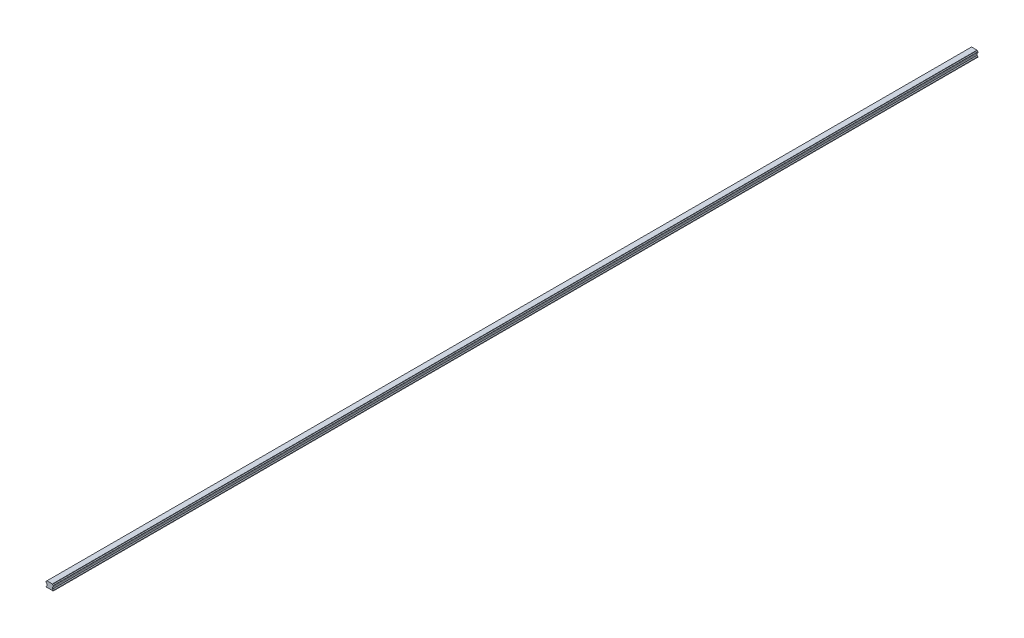
ISO-10303-21;
HEADER;
FILE_DESCRIPTION(('STEP AP214'),'2;1');
FILE_NAME('part.step','',(''),(''),'','','');
FILE_SCHEMA(('AUTOMOTIVE_DESIGN { 1 0 10303 214 1 1 1 1 }'));
ENDSEC;
DATA;
#1=APPLICATION_CONTEXT('core data for automotive mechanical design processes');
#2=APPLICATION_PROTOCOL_DEFINITION('international standard','automotive_design',2000,#1);
#3=PRODUCT_CONTEXT('',#1,'mechanical');
#4=PRODUCT('Part','Part','',(#3));
#5=PRODUCT_RELATED_PRODUCT_CATEGORY('part','',(#4));
#6=PRODUCT_DEFINITION_FORMATION('','',#4);
#7=PRODUCT_DEFINITION_CONTEXT('part definition',#1,'design');
#8=PRODUCT_DEFINITION('design','',#6,#7);
#9=PRODUCT_DEFINITION_SHAPE('','',#8);
#10=(LENGTH_UNIT() NAMED_UNIT(*) SI_UNIT(.MILLI.,.METRE.));
#11=(NAMED_UNIT(*) PLANE_ANGLE_UNIT() SI_UNIT($,.RADIAN.));
#12=(NAMED_UNIT(*) SI_UNIT($,.STERADIAN.) SOLID_ANGLE_UNIT());
#13=UNCERTAINTY_MEASURE_WITH_UNIT(LENGTH_MEASURE(1.E-05),#10,'distance_accuracy_value','');
#14=(GEOMETRIC_REPRESENTATION_CONTEXT(3) GLOBAL_UNCERTAINTY_ASSIGNED_CONTEXT((#13)) GLOBAL_UNIT_ASSIGNED_CONTEXT((#10,
#11,#12)) REPRESENTATION_CONTEXT('',''));
#15=CARTESIAN_POINT('',(0.,0.,0.));
#16=DIRECTION('',(0.,0.,1.));
#17=DIRECTION('',(1.,0.,0.));
#18=AXIS2_PLACEMENT_3D('',#15,#16,#17);
#19=CARTESIAN_POINT('',(-54230.8177693005,54214.4005653113,2897.));
#20=DIRECTION('',(0.707106781186546,0.707106781186549,0.));
#21=DIRECTION('',(-0.707106781186549,0.707106781186546,0.));
#22=AXIS2_PLACEMENT_3D('',#19,#20,#21);
#23=PLANE('',#22);
#24=DIRECTION('',(0.707106781186549,-0.707106781186546,0.));
#25=VECTOR('',#24,1.);
#26=CARTESIAN_POINT('',(-54230.8177693005,54214.4005653113,0.));
#27=LINE('',#26,#25);
#28=CARTESIAN_POINT('',(-10.5913828555799,-5.82582113338503,0.));
#29=VERTEX_POINT('',#28);
#30=CARTESIAN_POINT('',(-10.3951216023396,-6.02208238665242,0.));
#31=VERTEX_POINT('',#30);
#32=EDGE_CURVE('E212',#29,#31,#27,.T.);
#33=ORIENTED_EDGE('',*,*,#32,.T.);
#34=DIRECTION('',(0.,0.,-1.));
#35=VECTOR('',#34,1.);
#36=CARTESIAN_POINT('',(-10.3951216023396,-6.02208238665242,2897.));
#37=LINE('',#36,#35);
#38=CARTESIAN_POINT('',(-10.3951216023396,-6.02208238665242,2897.));
#39=VERTEX_POINT('',#38);
#40=EDGE_CURVE('E11',#39,#31,#37,.T.);
#41=ORIENTED_EDGE('',*,*,#40,.F.);
#42=DIRECTION('',(0.707106781186549,-0.707106781186546,0.));
#43=VECTOR('',#42,1.);
#44=CARTESIAN_POINT('',(-54230.8177693005,54214.4005653113,2897.));
#45=LINE('',#44,#43);
#46=CARTESIAN_POINT('',(-10.5913828555799,-5.82582113338503,2897.));
#47=VERTEX_POINT('',#46);
#48=EDGE_CURVE('E129',#47,#39,#45,.T.);
#49=ORIENTED_EDGE('',*,*,#48,.F.);
#50=DIRECTION('',(0.,0.,-1.));
#51=VECTOR('',#50,1.);
#52=CARTESIAN_POINT('',(-10.5913828555799,-5.82582113338503,2897.));
#53=LINE('',#52,#51);
#54=EDGE_CURVE('E211',#47,#29,#53,.T.);
#55=ORIENTED_EDGE('',*,*,#54,.T.);
#56=EDGE_LOOP('',(#33,#41,#49,#55));
#57=FACE_BOUND('',#56,.T.);
#58=ADVANCED_FACE('F32',(#57),#23,.F.);
#59=CARTESIAN_POINT('',(-10.5913828555866,-8.5358995422944,2897.));
#60=DIRECTION('',(0.,0.,-1.));
#61=DIRECTION('',(-1.,0.,0.));
#62=AXIS2_PLACEMENT_3D('',#59,#60,#61);
#63=CYLINDRICAL_SURFACE('',#62,2.52146686901217);
#64=CARTESIAN_POINT('',(-10.5913828555866,-8.5358995422944,0.));
#65=DIRECTION('',(0.,0.,1.));
#66=DIRECTION('',(1.,0.,0.));
#67=AXIS2_PLACEMENT_3D('',#64,#65,#66);
#68=CIRCLE('',#67,2.52146686901217);
#69=CARTESIAN_POINT('',(-8.07756569993501,-8.339638289101,0.));
#70=VERTEX_POINT('',#69);
#71=EDGE_CURVE('E215',#70,#31,#68,.T.);
#72=ORIENTED_EDGE('',*,*,#71,.F.);
#73=DIRECTION('',(0.,0.,-1.));
#74=VECTOR('',#73,1.);
#75=CARTESIAN_POINT('',(-8.07756569993501,-8.339638289101,2897.));
#76=LINE('',#75,#74);
#77=CARTESIAN_POINT('',(-8.07756569993501,-8.339638289101,2897.));
#78=VERTEX_POINT('',#77);
#79=EDGE_CURVE('E40',#78,#70,#76,.T.);
#80=ORIENTED_EDGE('',*,*,#79,.F.);
#81=CARTESIAN_POINT('',(-10.5913828555866,-8.5358995422944,2897.));
#82=DIRECTION('',(0.,0.,1.));
#83=DIRECTION('',(1.,0.,0.));
#84=AXIS2_PLACEMENT_3D('',#81,#82,#83);
#85=CIRCLE('',#84,2.52146686901217);
#86=EDGE_CURVE('E321',#78,#39,#85,.T.);
#87=ORIENTED_EDGE('',*,*,#86,.T.);
#88=ORIENTED_EDGE('',*,*,#40,.T.);
#89=EDGE_LOOP('',(#72,#80,#87,#88));
#90=FACE_BOUND('',#89,.T.);
#91=ADVANCED_FACE('F320',(#90),#63,.F.);
#92=CARTESIAN_POINT('',(-54230.8177693006,54214.4005653113,2897.));
#93=DIRECTION('',(0.707106781186546,0.707106781186549,0.));
#94=DIRECTION('',(-0.707106781186549,0.707106781186546,0.));
#95=AXIS2_PLACEMENT_3D('',#92,#93,#94);
#96=PLANE('',#95);
#97=DIRECTION('',(0.707106781186549,-0.707106781186546,0.));
#98=VECTOR('',#97,1.);
#99=CARTESIAN_POINT('',(-54230.8177693006,54214.4005653113,0.));
#100=LINE('',#99,#98);
#101=CARTESIAN_POINT('',(-7.56562261278759,-8.85158137623421,0.));
#102=VERTEX_POINT('',#101);
#103=EDGE_CURVE('E218',#70,#102,#100,.T.);
#104=ORIENTED_EDGE('',*,*,#103,.T.);
#105=DIRECTION('',(0.,0.,-1.));
#106=VECTOR('',#105,1.);
#107=CARTESIAN_POINT('',(-7.56562261278759,-8.85158137623421,2897.));
#108=LINE('',#107,#106);
#109=CARTESIAN_POINT('',(-7.56562261278759,-8.85158137623421,2897.));
#110=VERTEX_POINT('',#109);
#111=EDGE_CURVE('E304',#110,#102,#108,.T.);
#112=ORIENTED_EDGE('',*,*,#111,.F.);
#113=DIRECTION('',(0.707106781186549,-0.707106781186546,0.));
#114=VECTOR('',#113,1.);
#115=CARTESIAN_POINT('',(-54230.8177693006,54214.4005653113,2897.));
#116=LINE('',#115,#114);
#117=EDGE_CURVE('E311',#78,#110,#116,.T.);
#118=ORIENTED_EDGE('',*,*,#117,.F.);
#119=ORIENTED_EDGE('',*,*,#79,.T.);
#120=EDGE_LOOP('',(#104,#112,#118,#119));
#121=FACE_BOUND('',#120,.T.);
#122=ADVANCED_FACE('F309',(#121),#96,.F.);
#123=CARTESIAN_POINT('',(-7.56562261278759,-291553.774300648,2897.));
#124=DIRECTION('',(1.,0.,0.));
#125=DIRECTION('',(0.,0.,-1.));
#126=AXIS2_PLACEMENT_3D('',#123,#124,#125);
#127=PLANE('',#126);
#128=DIRECTION('',(0.,-1.,0.));
#129=VECTOR('',#128,1.);
#130=CARTESIAN_POINT('',(-7.56562261278759,-291553.774300648,0.));
#131=LINE('',#130,#129);
#132=CARTESIAN_POINT('',(-7.56562261273075,-13.8945151143162,0.));
#133=VERTEX_POINT('',#132);
#134=EDGE_CURVE('E220',#102,#133,#131,.T.);
#135=ORIENTED_EDGE('',*,*,#134,.T.);
#136=DIRECTION('',(0.,0.,-1.));
#137=VECTOR('',#136,1.);
#138=CARTESIAN_POINT('',(-7.56562261273075,-13.8945151143162,2897.));
#139=LINE('',#138,#137);
#140=CARTESIAN_POINT('',(-7.56562261273075,-13.8945151143162,2897.));
#141=VERTEX_POINT('',#140);
#142=EDGE_CURVE('E301',#141,#133,#139,.T.);
#143=ORIENTED_EDGE('',*,*,#142,.F.);
#144=DIRECTION('',(0.,-1.,0.));
#145=VECTOR('',#144,1.);
#146=CARTESIAN_POINT('',(-7.56562261278759,-291553.774300648,2897.));
#147=LINE('',#146,#145);
#148=EDGE_CURVE('E410',#110,#141,#147,.T.);
#149=ORIENTED_EDGE('',*,*,#148,.F.);
#150=ORIENTED_EDGE('',*,*,#111,.T.);
#151=EDGE_LOOP('',(#135,#143,#149,#150));
#152=FACE_BOUND('',#151,.T.);
#153=ADVANCED_FACE('F409',(#152),#127,.F.);
#154=CARTESIAN_POINT('',(-345773.219021702,-345779.547914204,2897.));
#155=DIRECTION('',(0.707106781186547,-0.707106781186548,0.));
#156=DIRECTION('',(0.707106781186548,0.707106781186547,0.));
#157=AXIS2_PLACEMENT_3D('',#154,#155,#156);
#158=PLANE('',#157);
#159=DIRECTION('',(-0.707106781186548,-0.707106781186547,0.));
#160=VECTOR('',#159,1.);
#161=CARTESIAN_POINT('',(-345773.219021702,-345779.547914204,0.));
#162=LINE('',#161,#160);
#163=CARTESIAN_POINT('',(-10.0870894817717,-16.4159819833003,0.));
#164=VERTEX_POINT('',#163);
#165=EDGE_CURVE('E222',#133,#164,#162,.T.);
#166=ORIENTED_EDGE('',*,*,#165,.T.);
#167=DIRECTION('',(0.,0.,-1.));
#168=VECTOR('',#167,1.);
#169=CARTESIAN_POINT('',(-10.0870894817717,-16.4159819833003,2897.));
#170=LINE('',#169,#168);
#171=CARTESIAN_POINT('',(-10.0870894817717,-16.4159819833003,2897.));
#172=VERTEX_POINT('',#171);
#173=EDGE_CURVE('E299',#172,#164,#170,.T.);
#174=ORIENTED_EDGE('',*,*,#173,.F.);
#175=DIRECTION('',(-0.707106781186548,-0.707106781186547,0.));
#176=VECTOR('',#175,1.);
#177=CARTESIAN_POINT('',(-345773.219021702,-345779.547914204,2897.));
#178=LINE('',#177,#176);
#179=EDGE_CURVE('E406',#141,#172,#178,.T.);
#180=ORIENTED_EDGE('',*,*,#179,.F.);
#181=ORIENTED_EDGE('',*,*,#142,.T.);
#182=EDGE_LOOP('',(#166,#174,#180,#181));
#183=FACE_BOUND('',#182,.T.);
#184=ADVANCED_FACE('F404',(#183),#158,.F.);
#185=CARTESIAN_POINT('',(-10.0870894817717,-291553.774300648,2897.));
#186=DIRECTION('',(-1.,0.,0.));
#187=DIRECTION('',(0.,0.,1.));
#188=AXIS2_PLACEMENT_3D('',#185,#186,#187);
#189=PLANE('',#188);
#190=DIRECTION('',(0.,1.,0.));
#191=VECTOR('',#190,1.);
#192=CARTESIAN_POINT('',(-10.0870894817717,-291553.774300648,0.));
#193=LINE('',#192,#191);
#194=CARTESIAN_POINT('',(-10.0870894817717,-17.7743006478295,0.));
#195=VERTEX_POINT('',#194);
#196=EDGE_CURVE('E225',#195,#164,#193,.T.);
#197=ORIENTED_EDGE('',*,*,#196,.F.);
#198=DIRECTION('',(0.,0.,-1.));
#199=VECTOR('',#198,1.);
#200=CARTESIAN_POINT('',(-10.0870894817717,-17.7743006478295,2897.));
#201=LINE('',#200,#199);
#202=CARTESIAN_POINT('',(-10.0870894817717,-17.7743006478295,2897.));
#203=VERTEX_POINT('',#202);
#204=EDGE_CURVE('E297',#203,#195,#201,.T.);
#205=ORIENTED_EDGE('',*,*,#204,.F.);
#206=DIRECTION('',(0.,1.,0.));
#207=VECTOR('',#206,1.);
#208=CARTESIAN_POINT('',(-10.0870894817717,-291553.774300648,2897.));
#209=LINE('',#208,#207);
#210=EDGE_CURVE('E401',#203,#172,#209,.T.);
#211=ORIENTED_EDGE('',*,*,#210,.T.);
#212=ORIENTED_EDGE('',*,*,#173,.T.);
#213=EDGE_LOOP('',(#197,#205,#211,#212));
#214=FACE_BOUND('',#213,.T.);
#215=ADVANCED_FACE('F397',(#214),#189,.T.);
#216=CARTESIAN_POINT('',(-399998.992635258,-17.7743006478295,2897.));
#217=DIRECTION('',(0.,-1.,0.));
#218=DIRECTION('',(0.,0.,-1.));
#219=AXIS2_PLACEMENT_3D('',#216,#217,#218);
#220=PLANE('',#219);
#221=DIRECTION('',(-1.,0.,0.));
#222=VECTOR('',#221,1.);
#223=CARTESIAN_POINT('',(-399998.992635258,-17.7743006478295,0.));
#224=LINE('',#223,#222);
#225=CARTESIAN_POINT('',(12.1018189655047,-17.7743006478295,0.));
#226=VERTEX_POINT('',#225);
#227=EDGE_CURVE('E228',#226,#195,#224,.T.);
#228=ORIENTED_EDGE('',*,*,#227,.F.);
#229=DIRECTION('',(0.,0.,-1.));
#230=VECTOR('',#229,1.);
#231=CARTESIAN_POINT('',(12.1018189655047,-17.7743006478295,2897.));
#232=LINE('',#231,#230);
#233=CARTESIAN_POINT('',(12.1018189655047,-17.7743006478295,2897.));
#234=VERTEX_POINT('',#233);
#235=EDGE_CURVE('E295',#234,#226,#232,.T.);
#236=ORIENTED_EDGE('',*,*,#235,.F.);
#237=DIRECTION('',(-1.,0.,0.));
#238=VECTOR('',#237,1.);
#239=CARTESIAN_POINT('',(-399998.992635258,-17.7743006478295,2897.));
#240=LINE('',#239,#238);
#241=EDGE_CURVE('E417',#234,#203,#240,.T.);
#242=ORIENTED_EDGE('',*,*,#241,.T.);
#243=ORIENTED_EDGE('',*,*,#204,.T.);
#244=EDGE_LOOP('',(#228,#236,#242,#243));
#245=FACE_BOUND('',#244,.T.);
#246=ADVANCED_FACE('F394',(#245),#220,.T.);
#247=CARTESIAN_POINT('',(12.1018189655047,-291553.774300648,2897.));
#248=DIRECTION('',(1.,0.,0.));
#249=DIRECTION('',(0.,0.,-1.));
#250=AXIS2_PLACEMENT_3D('',#247,#248,#249);
#251=PLANE('',#250);
#252=DIRECTION('',(0.,-1.,0.));
#253=VECTOR('',#252,1.);
#254=CARTESIAN_POINT('',(12.1018189655047,-291553.774300648,0.));
#255=LINE('',#254,#253);
#256=CARTESIAN_POINT('',(12.1018189655118,-16.4159819832363,0.));
#257=VERTEX_POINT('',#256);
#258=EDGE_CURVE('E231',#257,#226,#255,.T.);
#259=ORIENTED_EDGE('',*,*,#258,.F.);
#260=DIRECTION('',(0.,0.,-1.));
#261=VECTOR('',#260,1.);
#262=CARTESIAN_POINT('',(12.1018189655118,-16.4159819832363,2897.));
#263=LINE('',#262,#261);
#264=CARTESIAN_POINT('',(12.1018189655118,-16.4159819832363,2897.));
#265=VERTEX_POINT('',#264);
#266=EDGE_CURVE('E293',#265,#257,#263,.T.);
#267=ORIENTED_EDGE('',*,*,#266,.F.);
#268=DIRECTION('',(0.,-1.,0.));
#269=VECTOR('',#268,1.);
#270=CARTESIAN_POINT('',(12.1018189655047,-291553.774300648,2897.));
#271=LINE('',#270,#269);
#272=EDGE_CURVE('E390',#265,#234,#271,.T.);
#273=ORIENTED_EDGE('',*,*,#272,.T.);
#274=ORIENTED_EDGE('',*,*,#235,.T.);
#275=EDGE_LOOP('',(#259,#267,#273,#274));
#276=FACE_BOUND('',#275,.T.);
#277=ADVANCED_FACE('F387',(#276),#251,.T.);
#278=CARTESIAN_POINT('',(-54224.7662488138,54220.4520857961,2897.));
#279=DIRECTION('',(-0.707106781186548,-0.707106781186547,0.));
#280=DIRECTION('',(0.707106781186547,-0.707106781186548,0.));
#281=AXIS2_PLACEMENT_3D('',#278,#279,#280);
#282=PLANE('',#281);
#283=DIRECTION('',(-0.707106781186547,0.707106781186548,0.));
#284=VECTOR('',#283,1.);
#285=CARTESIAN_POINT('',(-54224.7662488138,54220.4520857961,0.));
#286=LINE('',#285,#284);
#287=CARTESIAN_POINT('',(9.58035209652053,-13.8945151142593,0.));
#288=VERTEX_POINT('',#287);
#289=EDGE_CURVE('E234',#257,#288,#286,.T.);
#290=ORIENTED_EDGE('',*,*,#289,.T.);
#291=DIRECTION('',(0.,0.,-1.));
#292=VECTOR('',#291,1.);
#293=CARTESIAN_POINT('',(9.58035209652053,-13.8945151142593,2897.));
#294=LINE('',#293,#292);
#295=CARTESIAN_POINT('',(9.58035209652053,-13.8945151142593,2897.));
#296=VERTEX_POINT('',#295);
#297=EDGE_CURVE('E290',#296,#288,#294,.T.);
#298=ORIENTED_EDGE('',*,*,#297,.F.);
#299=DIRECTION('',(-0.707106781186547,0.707106781186548,0.));
#300=VECTOR('',#299,1.);
#301=CARTESIAN_POINT('',(-54224.7662488138,54220.4520857961,2897.));
#302=LINE('',#301,#300);
#303=EDGE_CURVE('E383',#265,#296,#302,.T.);
#304=ORIENTED_EDGE('',*,*,#303,.F.);
#305=ORIENTED_EDGE('',*,*,#266,.T.);
#306=EDGE_LOOP('',(#290,#298,#304,#305));
#307=FACE_BOUND('',#306,.T.);
#308=ADVANCED_FACE('F382',(#307),#282,.F.);
#309=CARTESIAN_POINT('',(9.58035209652053,-291553.774300648,2897.));
#310=DIRECTION('',(-1.,0.,0.));
#311=DIRECTION('',(0.,0.,1.));
#312=AXIS2_PLACEMENT_3D('',#309,#310,#311);
#313=PLANE('',#312);
#314=DIRECTION('',(0.,1.,0.));
#315=VECTOR('',#314,1.);
#316=CARTESIAN_POINT('',(9.58035209652053,-291553.774300648,0.));
#317=LINE('',#316,#315);
#318=CARTESIAN_POINT('',(9.58035209657737,-8.85158137629105,0.));
#319=VERTEX_POINT('',#318);
#320=EDGE_CURVE('E236',#288,#319,#317,.T.);
#321=ORIENTED_EDGE('',*,*,#320,.T.);
#322=DIRECTION('',(0.,0.,-1.));
#323=VECTOR('',#322,1.);
#324=CARTESIAN_POINT('',(9.58035209657737,-8.85158137629105,2897.));
#325=LINE('',#324,#323);
#326=CARTESIAN_POINT('',(9.58035209657737,-8.85158137629105,2897.));
#327=VERTEX_POINT('',#326);
#328=EDGE_CURVE('E287',#327,#319,#325,.T.);
#329=ORIENTED_EDGE('',*,*,#328,.F.);
#330=DIRECTION('',(0.,1.,0.));
#331=VECTOR('',#330,1.);
#332=CARTESIAN_POINT('',(9.58035209652053,-291553.774300648,2897.));
#333=LINE('',#332,#331);
#334=EDGE_CURVE('E378',#296,#327,#333,.T.);
#335=ORIENTED_EDGE('',*,*,#334,.F.);
#336=ORIENTED_EDGE('',*,*,#297,.T.);
#337=EDGE_LOOP('',(#321,#329,#335,#336));
#338=FACE_BOUND('',#337,.T.);
#339=ADVANCED_FACE('F377',(#338),#313,.F.);
#340=CARTESIAN_POINT('',(-345767.167501216,-345785.59943469,2897.));
#341=DIRECTION('',(-0.707106781186549,0.707106781186546,0.));
#342=DIRECTION('',(-0.707106781186546,-0.707106781186549,0.));
#343=AXIS2_PLACEMENT_3D('',#340,#341,#342);
#344=PLANE('',#343);
#345=DIRECTION('',(0.707106781186546,0.707106781186549,0.));
#346=VECTOR('',#345,1.);
#347=CARTESIAN_POINT('',(-345767.167501216,-345785.59943469,0.));
#348=LINE('',#347,#346);
#349=CARTESIAN_POINT('',(10.0922951836753,-8.3396382891551,0.));
#350=VERTEX_POINT('',#349);
#351=EDGE_CURVE('E238',#319,#350,#348,.T.);
#352=ORIENTED_EDGE('',*,*,#351,.T.);
#353=DIRECTION('',(0.,0.,-1.));
#354=VECTOR('',#353,1.);
#355=CARTESIAN_POINT('',(10.0922951836753,-8.3396382891551,2897.));
#356=LINE('',#355,#354);
#357=CARTESIAN_POINT('',(10.0922951836753,-8.3396382891551,2897.));
#358=VERTEX_POINT('',#357);
#359=EDGE_CURVE('E285',#358,#350,#356,.T.);
#360=ORIENTED_EDGE('',*,*,#359,.F.);
#361=DIRECTION('',(0.707106781186546,0.707106781186549,0.));
#362=VECTOR('',#361,1.);
#363=CARTESIAN_POINT('',(-345767.167501216,-345785.59943469,2897.));
#364=LINE('',#363,#362);
#365=EDGE_CURVE('E374',#327,#358,#364,.T.);
#366=ORIENTED_EDGE('',*,*,#365,.F.);
#367=ORIENTED_EDGE('',*,*,#328,.T.);
#368=EDGE_LOOP('',(#352,#360,#366,#367));
#369=FACE_BOUND('',#368,.T.);
#370=ADVANCED_FACE('F371',(#369),#344,.F.);
#371=CARTESIAN_POINT('',(12.6061123393257,-8.53589954229437,2897.));
#372=DIRECTION('',(0.,0.,-1.));
#373=DIRECTION('',(-1.,0.,0.));
#374=AXIS2_PLACEMENT_3D('',#371,#372,#373);
#375=CYLINDRICAL_SURFACE('',#374,2.52146686901217);
#376=CARTESIAN_POINT('',(12.6061123393257,-8.53589954229437,0.));
#377=DIRECTION('',(0.,0.,1.));
#378=DIRECTION('',(1.,0.,0.));
#379=AXIS2_PLACEMENT_3D('',#376,#377,#378);
#380=CIRCLE('',#379,2.52146686901217);
#381=CARTESIAN_POINT('',(12.4098510862041,-6.02208238660751,0.));
#382=VERTEX_POINT('',#381);
#383=EDGE_CURVE('E241',#382,#350,#380,.T.);
#384=ORIENTED_EDGE('',*,*,#383,.F.);
#385=DIRECTION('',(0.,0.,-1.));
#386=VECTOR('',#385,1.);
#387=CARTESIAN_POINT('',(12.4098510862041,-6.02208238660751,2897.));
#388=LINE('',#387,#386);
#389=CARTESIAN_POINT('',(12.4098510862041,-6.02208238660751,2897.));
#390=VERTEX_POINT('',#389);
#391=EDGE_CURVE('E283',#390,#382,#388,.T.);
#392=ORIENTED_EDGE('',*,*,#391,.F.);
#393=CARTESIAN_POINT('',(12.6061123393257,-8.53589954229437,2897.));
#394=DIRECTION('',(0.,0.,1.));
#395=DIRECTION('',(1.,0.,0.));
#396=AXIS2_PLACEMENT_3D('',#393,#394,#395);
#397=CIRCLE('',#396,2.52146686901217);
#398=EDGE_CURVE('E365',#390,#358,#397,.T.);
#399=ORIENTED_EDGE('',*,*,#398,.T.);
#400=ORIENTED_EDGE('',*,*,#359,.T.);
#401=EDGE_LOOP('',(#384,#392,#399,#400));
#402=FACE_BOUND('',#401,.T.);
#403=ADVANCED_FACE('F364',(#402),#375,.F.);
#404=CARTESIAN_POINT('',(-345767.167501217,-345785.599434689,2897.));
#405=DIRECTION('',(-0.707106781186547,0.707106781186547,0.));
#406=DIRECTION('',(-0.707106781186548,-0.707106781186548,0.));
#407=AXIS2_PLACEMENT_3D('',#404,#405,#406);
#408=PLANE('',#407);
#409=DIRECTION('',(0.707106781186548,0.707106781186548,0.));
#410=VECTOR('',#409,1.);
#411=CARTESIAN_POINT('',(-345767.167501217,-345785.599434689,0.));
#412=LINE('',#411,#410);
#413=CARTESIAN_POINT('',(12.6061123393129,-5.82582113338503,0.));
#414=VERTEX_POINT('',#413);
#415=EDGE_CURVE('E244',#382,#414,#412,.T.);
#416=ORIENTED_EDGE('',*,*,#415,.T.);
#417=DIRECTION('',(0.,0.,-1.));
#418=VECTOR('',#417,1.);
#419=CARTESIAN_POINT('',(12.6061123393129,-5.82582113338503,2897.));
#420=LINE('',#419,#418);
#421=CARTESIAN_POINT('',(12.6061123393129,-5.82582113338503,2897.));
#422=VERTEX_POINT('',#421);
#423=EDGE_CURVE('E280',#422,#414,#420,.T.);
#424=ORIENTED_EDGE('',*,*,#423,.F.);
#425=DIRECTION('',(0.707106781186548,0.707106781186548,0.));
#426=VECTOR('',#425,1.);
#427=CARTESIAN_POINT('',(-345767.167501217,-345785.599434689,2897.));
#428=LINE('',#427,#426);
#429=EDGE_CURVE('E360',#390,#422,#428,.T.);
#430=ORIENTED_EDGE('',*,*,#429,.F.);
#431=ORIENTED_EDGE('',*,*,#391,.T.);
#432=EDGE_LOOP('',(#416,#424,#430,#431));
#433=FACE_BOUND('',#432,.T.);
#434=ADVANCED_FACE('F359',(#433),#408,.F.);
#435=CARTESIAN_POINT('',(12.6061123393129,-291553.774300648,2897.));
#436=DIRECTION('',(-1.,0.,0.));
#437=DIRECTION('',(0.,0.,1.));
#438=AXIS2_PLACEMENT_3D('',#435,#436,#437);
#439=PLANE('',#438);
#440=DIRECTION('',(0.,1.,0.));
#441=VECTOR('',#440,1.);
#442=CARTESIAN_POINT('',(12.6061123393129,-291553.774300648,0.));
#443=LINE('',#442,#441);
#444=CARTESIAN_POINT('',(12.60611233932,-2.80006089064244,0.));
#445=VERTEX_POINT('',#444);
#446=EDGE_CURVE('E246',#414,#445,#443,.T.);
#447=ORIENTED_EDGE('',*,*,#446,.T.);
#448=DIRECTION('',(0.,0.,-1.));
#449=VECTOR('',#448,1.);
#450=CARTESIAN_POINT('',(12.60611233932,-2.80006089064244,2897.));
#451=LINE('',#450,#449);
#452=CARTESIAN_POINT('',(12.60611233932,-2.80006089064244,2897.));
#453=VERTEX_POINT('',#452);
#454=EDGE_CURVE('E277',#453,#445,#451,.T.);
#455=ORIENTED_EDGE('',*,*,#454,.F.);
#456=DIRECTION('',(0.,1.,0.));
#457=VECTOR('',#456,1.);
#458=CARTESIAN_POINT('',(12.6061123393129,-291553.774300648,2897.));
#459=LINE('',#458,#457);
#460=EDGE_CURVE('E356',#422,#453,#459,.T.);
#461=ORIENTED_EDGE('',*,*,#460,.F.);
#462=ORIENTED_EDGE('',*,*,#423,.T.);
#463=EDGE_LOOP('',(#447,#455,#461,#462));
#464=FACE_BOUND('',#463,.T.);
#465=ADVANCED_FACE('F353',(#464),#439,.F.);
#466=CARTESIAN_POINT('',(-54217.7061415812,54227.5121930298,2897.));
#467=DIRECTION('',(-0.707106781186547,-0.707106781186548,0.));
#468=DIRECTION('',(0.707106781186548,-0.707106781186547,0.));
#469=AXIS2_PLACEMENT_3D('',#466,#467,#468);
#470=PLANE('',#469);
#471=DIRECTION('',(-0.707106781186548,0.707106781186547,0.));
#472=VECTOR('',#471,1.);
#473=CARTESIAN_POINT('',(-54217.7061415812,54227.5121930298,0.));
#474=LINE('',#473,#472);
#475=CARTESIAN_POINT('',(12.4098510860982,-2.60379963741146,0.));
#476=VERTEX_POINT('',#475);
#477=EDGE_CURVE('E248',#445,#476,#474,.T.);
#478=ORIENTED_EDGE('',*,*,#477,.T.);
#479=DIRECTION('',(0.,0.,-1.));
#480=VECTOR('',#479,1.);
#481=CARTESIAN_POINT('',(12.4098510860982,-2.60379963741146,2897.));
#482=LINE('',#481,#480);
#483=CARTESIAN_POINT('',(12.4098510860982,-2.60379963741146,2897.));
#484=VERTEX_POINT('',#483);
#485=EDGE_CURVE('E275',#484,#476,#482,.T.);
#486=ORIENTED_EDGE('',*,*,#485,.F.);
#487=DIRECTION('',(-0.707106781186548,0.707106781186547,0.));
#488=VECTOR('',#487,1.);
#489=CARTESIAN_POINT('',(-54217.7061415812,54227.5121930298,2897.));
#490=LINE('',#489,#488);
#491=EDGE_CURVE('E426',#453,#484,#490,.T.);
#492=ORIENTED_EDGE('',*,*,#491,.F.);
#493=ORIENTED_EDGE('',*,*,#454,.T.);
#494=EDGE_LOOP('',(#478,#486,#492,#493));
#495=FACE_BOUND('',#494,.T.);
#496=ADVANCED_FACE('F347',(#495),#470,.F.);
#497=CARTESIAN_POINT('',(12.6061123393258,-0.0899824817679875,2897.));
#498=DIRECTION('',(0.,0.,-1.));
#499=DIRECTION('',(-1.,0.,0.));
#500=AXIS2_PLACEMENT_3D('',#497,#498,#499);
#501=CYLINDRICAL_SURFACE('',#500,2.52146686901215);
#502=CARTESIAN_POINT('',(12.6061123393258,-0.0899824817679875,0.));
#503=DIRECTION('',(0.,0.,1.));
#504=DIRECTION('',(1.,0.,0.));
#505=AXIS2_PLACEMENT_3D('',#502,#503,#504);
#506=CIRCLE('',#505,2.52146686901215);
#507=CARTESIAN_POINT('',(10.092295183675,-0.286243734990421,0.));
#508=VERTEX_POINT('',#507);
#509=EDGE_CURVE('E251',#508,#476,#506,.T.);
#510=ORIENTED_EDGE('',*,*,#509,.F.);
#511=DIRECTION('',(0.,0.,-1.));
#512=VECTOR('',#511,1.);
#513=CARTESIAN_POINT('',(10.092295183675,-0.286243734990421,2897.));
#514=LINE('',#513,#512);
#515=CARTESIAN_POINT('',(10.092295183675,-0.286243734990421,2897.));
#516=VERTEX_POINT('',#515);
#517=EDGE_CURVE('E273',#516,#508,#514,.T.);
#518=ORIENTED_EDGE('',*,*,#517,.F.);
#519=CARTESIAN_POINT('',(12.6061123393258,-0.0899824817679875,2897.));
#520=DIRECTION('',(0.,0.,1.));
#521=DIRECTION('',(1.,0.,0.));
#522=AXIS2_PLACEMENT_3D('',#519,#520,#521);
#523=CIRCLE('',#522,2.52146686901215);
#524=EDGE_CURVE('E344',#516,#484,#523,.T.);
#525=ORIENTED_EDGE('',*,*,#524,.T.);
#526=ORIENTED_EDGE('',*,*,#485,.T.);
#527=EDGE_LOOP('',(#510,#518,#525,#526));
#528=FACE_BOUND('',#527,.T.);
#529=ADVANCED_FACE('F341',(#528),#501,.F.);
#530=CARTESIAN_POINT('',(-54217.7061415813,54227.5121930298,2897.));
#531=DIRECTION('',(-0.707106781186547,-0.707106781186548,0.));
#532=DIRECTION('',(0.707106781186548,-0.707106781186547,0.));
#533=AXIS2_PLACEMENT_3D('',#530,#531,#532);
#534=PLANE('',#533);
#535=DIRECTION('',(-0.707106781186548,0.707106781186547,0.));
#536=VECTOR('',#535,1.);
#537=CARTESIAN_POINT('',(-54217.7061415813,54227.5121930298,0.));
#538=LINE('',#537,#536);
#539=CARTESIAN_POINT('',(9.58035209652053,0.225699352199626,0.));
#540=VERTEX_POINT('',#539);
#541=EDGE_CURVE('E254',#508,#540,#538,.T.);
#542=ORIENTED_EDGE('',*,*,#541,.T.);
#543=DIRECTION('',(0.,0.,-1.));
#544=VECTOR('',#543,1.);
#545=CARTESIAN_POINT('',(9.58035209652053,0.225699352199626,2897.));
#546=LINE('',#545,#544);
#547=CARTESIAN_POINT('',(9.58035209652053,0.225699352199626,2897.));
#548=VERTEX_POINT('',#547);
#549=EDGE_CURVE('E270',#548,#540,#546,.T.);
#550=ORIENTED_EDGE('',*,*,#549,.F.);
#551=DIRECTION('',(-0.707106781186548,0.707106781186547,0.));
#552=VECTOR('',#551,1.);
#553=CARTESIAN_POINT('',(-54217.7061415813,54227.5121930298,2897.));
#554=LINE('',#553,#552);
#555=EDGE_CURVE('E336',#516,#548,#554,.T.);
#556=ORIENTED_EDGE('',*,*,#555,.F.);
#557=ORIENTED_EDGE('',*,*,#517,.T.);
#558=EDGE_LOOP('',(#542,#550,#556,#557));
#559=FACE_BOUND('',#558,.T.);
#560=ADVANCED_FACE('F335',(#559),#534,.F.);
#561=CARTESIAN_POINT('',(-399998.992635258,0.225699352199626,2897.));
#562=DIRECTION('',(0.,-1.,0.));
#563=DIRECTION('',(0.,0.,-1.));
#564=AXIS2_PLACEMENT_3D('',#561,#562,#563);
#565=PLANE('',#564);
#566=DIRECTION('',(-1.,0.,0.));
#567=VECTOR('',#566,1.);
#568=CARTESIAN_POINT('',(-399998.992635258,0.225699352199626,0.));
#569=LINE('',#568,#567);
#570=CARTESIAN_POINT('',(-7.56562261278759,0.225699352199626,0.));
#571=VERTEX_POINT('',#570);
#572=EDGE_CURVE('E256',#540,#571,#569,.T.);
#573=ORIENTED_EDGE('',*,*,#572,.T.);
#574=DIRECTION('',(0.,0.,-1.));
#575=VECTOR('',#574,1.);
#576=CARTESIAN_POINT('',(-7.56562261278759,0.225699352199626,2897.));
#577=LINE('',#576,#575);
#578=CARTESIAN_POINT('',(-7.56562261278759,0.225699352199626,2897.));
#579=VERTEX_POINT('',#578);
#580=EDGE_CURVE('E267',#579,#571,#577,.T.);
#581=ORIENTED_EDGE('',*,*,#580,.F.);
#582=DIRECTION('',(-1.,0.,0.));
#583=VECTOR('',#582,1.);
#584=CARTESIAN_POINT('',(-399998.992635258,0.225699352199626,2897.));
#585=LINE('',#584,#583);
#586=EDGE_CURVE('E206',#548,#579,#585,.T.);
#587=ORIENTED_EDGE('',*,*,#586,.F.);
#588=ORIENTED_EDGE('',*,*,#549,.T.);
#589=EDGE_LOOP('',(#573,#581,#587,#588));
#590=FACE_BOUND('',#589,.T.);
#591=ADVANCED_FACE('F331',(#590),#565,.F.);
#592=CARTESIAN_POINT('',(-345780.279128934,-345772.487806971,2897.));
#593=DIRECTION('',(0.707106781186549,-0.707106781186546,0.));
#594=DIRECTION('',(0.707106781186546,0.707106781186549,0.));
#595=AXIS2_PLACEMENT_3D('',#592,#593,#594);
#596=PLANE('',#595);
#597=DIRECTION('',(-0.707106781186546,-0.707106781186549,0.));
#598=VECTOR('',#597,1.);
#599=CARTESIAN_POINT('',(-345780.279128934,-345772.487806971,0.));
#600=LINE('',#599,#598);
#601=CARTESIAN_POINT('',(-8.07756569993827,-0.286243734932215,0.));
#602=VERTEX_POINT('',#601);
#603=EDGE_CURVE('E258',#571,#602,#600,.T.);
#604=ORIENTED_EDGE('',*,*,#603,.T.);
#605=DIRECTION('',(0.,0.,-1.));
#606=VECTOR('',#605,1.);
#607=CARTESIAN_POINT('',(-8.07756569993827,-0.286243734932215,2897.));
#608=LINE('',#607,#606);
#609=CARTESIAN_POINT('',(-8.07756569993827,-0.286243734932215,2897.));
#610=VERTEX_POINT('',#609);
#611=EDGE_CURVE('E195',#610,#602,#608,.T.);
#612=ORIENTED_EDGE('',*,*,#611,.F.);
#613=DIRECTION('',(-0.707106781186546,-0.707106781186549,0.));
#614=VECTOR('',#613,1.);
#615=CARTESIAN_POINT('',(-345780.279128934,-345772.487806971,2897.));
#616=LINE('',#615,#614);
#617=EDGE_CURVE('E203',#579,#610,#616,.T.);
#618=ORIENTED_EDGE('',*,*,#617,.F.);
#619=ORIENTED_EDGE('',*,*,#580,.T.);
#620=EDGE_LOOP('',(#604,#612,#618,#619));
#621=FACE_BOUND('',#620,.T.);
#622=ADVANCED_FACE('F327',(#621),#596,.F.);
#623=CARTESIAN_POINT('',(-10.5913828555866,-0.0899824817683164,2897.));
#624=DIRECTION('',(0.,0.,-1.));
#625=DIRECTION('',(-1.,0.,0.));
#626=AXIS2_PLACEMENT_3D('',#623,#624,#625);
#627=CYLINDRICAL_SURFACE('',#626,2.521466869012);
#628=CARTESIAN_POINT('',(-10.5913828555866,-0.0899824817683164,0.));
#629=DIRECTION('',(0.,0.,1.));
#630=DIRECTION('',(1.,0.,0.));
#631=AXIS2_PLACEMENT_3D('',#628,#629,#630);
#632=CIRCLE('',#631,2.521466869012);
#633=CARTESIAN_POINT('',(-10.3951216023006,-2.60379963737023,0.));
#634=VERTEX_POINT('',#633);
#635=EDGE_CURVE('E194',#634,#602,#632,.T.);
#636=ORIENTED_EDGE('',*,*,#635,.F.);
#637=DIRECTION('',(0.,0.,-1.));
#638=VECTOR('',#637,1.);
#639=CARTESIAN_POINT('',(-10.3951216023006,-2.60379963737023,2897.));
#640=LINE('',#639,#638);
#641=CARTESIAN_POINT('',(-10.3951216023006,-2.60379963737023,2897.));
#642=VERTEX_POINT('',#641);
#643=EDGE_CURVE('E188',#642,#634,#640,.T.);
#644=ORIENTED_EDGE('',*,*,#643,.F.);
#645=CARTESIAN_POINT('',(-10.5913828555866,-0.0899824817683164,2897.));
#646=DIRECTION('',(0.,0.,1.));
#647=DIRECTION('',(1.,0.,0.));
#648=AXIS2_PLACEMENT_3D('',#645,#646,#647);
#649=CIRCLE('',#648,2.521466869012);
#650=EDGE_CURVE('E192',#642,#610,#649,.T.);
#651=ORIENTED_EDGE('',*,*,#650,.T.);
#652=ORIENTED_EDGE('',*,*,#611,.T.);
#653=EDGE_LOOP('',(#636,#644,#651,#652));
#654=FACE_BOUND('',#653,.T.);
#655=ADVANCED_FACE('F190',(#654),#627,.F.);
#656=CARTESIAN_POINT('',(-345780.279128936,-345772.48780697,2897.));
#657=DIRECTION('',(0.707106781186547,-0.707106781186548,0.));
#658=DIRECTION('',(0.707106781186548,0.707106781186547,0.));
#659=AXIS2_PLACEMENT_3D('',#656,#657,#658);
#660=PLANE('',#659);
#661=DIRECTION('',(-0.707106781186548,-0.707106781186547,0.));
#662=VECTOR('',#661,1.);
#663=CARTESIAN_POINT('',(-345780.279128936,-345772.48780697,0.));
#664=LINE('',#663,#662);
#665=CARTESIAN_POINT('',(-10.5913828555799,-2.80006089053586,0.));
#666=VERTEX_POINT('',#665);
#667=EDGE_CURVE('E117',#634,#666,#664,.T.);
#668=ORIENTED_EDGE('',*,*,#667,.T.);
#669=DIRECTION('',(0.,0.,-1.));
#670=VECTOR('',#669,1.);
#671=CARTESIAN_POINT('',(-10.5913828555799,-2.80006089053586,2897.));
#672=LINE('',#671,#670);
#673=CARTESIAN_POINT('',(-10.5913828555799,-2.80006089053586,2897.));
#674=VERTEX_POINT('',#673);
#675=EDGE_CURVE('E196',#674,#666,#672,.T.);
#676=ORIENTED_EDGE('',*,*,#675,.F.);
#677=DIRECTION('',(-0.707106781186548,-0.707106781186547,0.));
#678=VECTOR('',#677,1.);
#679=CARTESIAN_POINT('',(-345780.279128936,-345772.48780697,2897.));
#680=LINE('',#679,#678);
#681=EDGE_CURVE('E198',#642,#674,#680,.T.);
#682=ORIENTED_EDGE('',*,*,#681,.F.);
#683=ORIENTED_EDGE('',*,*,#643,.T.);
#684=EDGE_LOOP('',(#668,#676,#682,#683));
#685=FACE_BOUND('',#684,.T.);
#686=ADVANCED_FACE('F199',(#685),#660,.F.);
#687=CARTESIAN_POINT('',(-10.5913828555799,-291553.774300648,2897.));
#688=DIRECTION('',(1.,0.,0.));
#689=DIRECTION('',(0.,0.,-1.));
#690=AXIS2_PLACEMENT_3D('',#687,#688,#689);
#691=PLANE('',#690);
#692=DIRECTION('',(0.,-1.,0.));
#693=VECTOR('',#692,1.);
#694=CARTESIAN_POINT('',(-10.5913828555799,-291553.774300648,0.));
#695=LINE('',#694,#693);
#696=EDGE_CURVE('E123',#666,#29,#695,.T.);
#697=ORIENTED_EDGE('',*,*,#696,.T.);
#698=ORIENTED_EDGE('',*,*,#54,.F.);
#699=DIRECTION('',(0.,-1.,0.));
#700=VECTOR('',#699,1.);
#701=CARTESIAN_POINT('',(-10.5913828555799,-291553.774300648,2897.));
#702=LINE('',#701,#700);
#703=EDGE_CURVE('E48',#674,#47,#702,.T.);
#704=ORIENTED_EDGE('',*,*,#703,.F.);
#705=ORIENTED_EDGE('',*,*,#675,.T.);
#706=EDGE_LOOP('',(#697,#698,#704,#705));
#707=FACE_BOUND('',#706,.T.);
#708=ADVANCED_FACE('F587',(#707),#691,.F.);
#709=CARTESIAN_POINT('',(-10.5913828555866,-8.5358995422944,2897.));
#710=DIRECTION('',(0.,0.,1.));
#711=DIRECTION('',(1.,0.,0.));
#712=AXIS2_PLACEMENT_3D('',#709,#710,#711);
#713=PLANE('',#712);
#714=ORIENTED_EDGE('',*,*,#48,.T.);
#715=ORIENTED_EDGE('',*,*,#86,.F.);
#716=ORIENTED_EDGE('',*,*,#117,.T.);
#717=ORIENTED_EDGE('',*,*,#148,.T.);
#718=ORIENTED_EDGE('',*,*,#179,.T.);
#719=ORIENTED_EDGE('',*,*,#210,.F.);
#720=ORIENTED_EDGE('',*,*,#241,.F.);
#721=ORIENTED_EDGE('',*,*,#272,.F.);
#722=ORIENTED_EDGE('',*,*,#303,.T.);
#723=ORIENTED_EDGE('',*,*,#334,.T.);
#724=ORIENTED_EDGE('',*,*,#365,.T.);
#725=ORIENTED_EDGE('',*,*,#398,.F.);
#726=ORIENTED_EDGE('',*,*,#429,.T.);
#727=ORIENTED_EDGE('',*,*,#460,.T.);
#728=ORIENTED_EDGE('',*,*,#491,.T.);
#729=ORIENTED_EDGE('',*,*,#524,.F.);
#730=ORIENTED_EDGE('',*,*,#555,.T.);
#731=ORIENTED_EDGE('',*,*,#586,.T.);
#732=ORIENTED_EDGE('',*,*,#617,.T.);
#733=ORIENTED_EDGE('',*,*,#650,.F.);
#734=ORIENTED_EDGE('',*,*,#681,.T.);
#735=ORIENTED_EDGE('',*,*,#703,.T.);
#736=EDGE_LOOP('',(#714,#715,#716,#717,#718,#719,#720,#721,#722,#723,#724,#725,#726,#727,#728,
#729,#730,#731,#732,#733,#734,#735));
#737=FACE_BOUND('',#736,.T.);
#738=ADVANCED_FACE('F201',(#737),#713,.T.);
#739=CARTESIAN_POINT('',(-10.5913828555866,-8.5358995422944,0.));
#740=DIRECTION('',(0.,0.,1.));
#741=DIRECTION('',(1.,0.,0.));
#742=AXIS2_PLACEMENT_3D('',#739,#740,#741);
#743=PLANE('',#742);
#744=ORIENTED_EDGE('',*,*,#32,.F.);
#745=ORIENTED_EDGE('',*,*,#696,.F.);
#746=ORIENTED_EDGE('',*,*,#667,.F.);
#747=ORIENTED_EDGE('',*,*,#635,.T.);
#748=ORIENTED_EDGE('',*,*,#603,.F.);
#749=ORIENTED_EDGE('',*,*,#572,.F.);
#750=ORIENTED_EDGE('',*,*,#541,.F.);
#751=ORIENTED_EDGE('',*,*,#509,.T.);
#752=ORIENTED_EDGE('',*,*,#477,.F.);
#753=ORIENTED_EDGE('',*,*,#446,.F.);
#754=ORIENTED_EDGE('',*,*,#415,.F.);
#755=ORIENTED_EDGE('',*,*,#383,.T.);
#756=ORIENTED_EDGE('',*,*,#351,.F.);
#757=ORIENTED_EDGE('',*,*,#320,.F.);
#758=ORIENTED_EDGE('',*,*,#289,.F.);
#759=ORIENTED_EDGE('',*,*,#258,.T.);
#760=ORIENTED_EDGE('',*,*,#227,.T.);
#761=ORIENTED_EDGE('',*,*,#196,.T.);
#762=ORIENTED_EDGE('',*,*,#165,.F.);
#763=ORIENTED_EDGE('',*,*,#134,.F.);
#764=ORIENTED_EDGE('',*,*,#103,.F.);
#765=ORIENTED_EDGE('',*,*,#71,.T.);
#766=EDGE_LOOP('',(#744,#745,#746,#747,#748,#749,#750,#751,#752,#753,#754,#755,#756,#757,#758,
#759,#760,#761,#762,#763,#764,#765));
#767=FACE_BOUND('',#766,.T.);
#768=ADVANCED_FACE('F318',(#767),#743,.F.);
#769=CLOSED_SHELL('',(#58,#91,#122,#153,#184,#215,#246,#277,#308,#339,#370,#403,#434,#465,#496,
#529,#560,#591,#622,#655,#686,#708,#738,#768));
#770=MANIFOLD_SOLID_BREP('B2',#769);
#771=ADVANCED_BREP_SHAPE_REPRESENTATION('',(#18,#770),#14);
#772=SHAPE_DEFINITION_REPRESENTATION(#9,#771);
ENDSEC;
END-ISO-10303-21;
